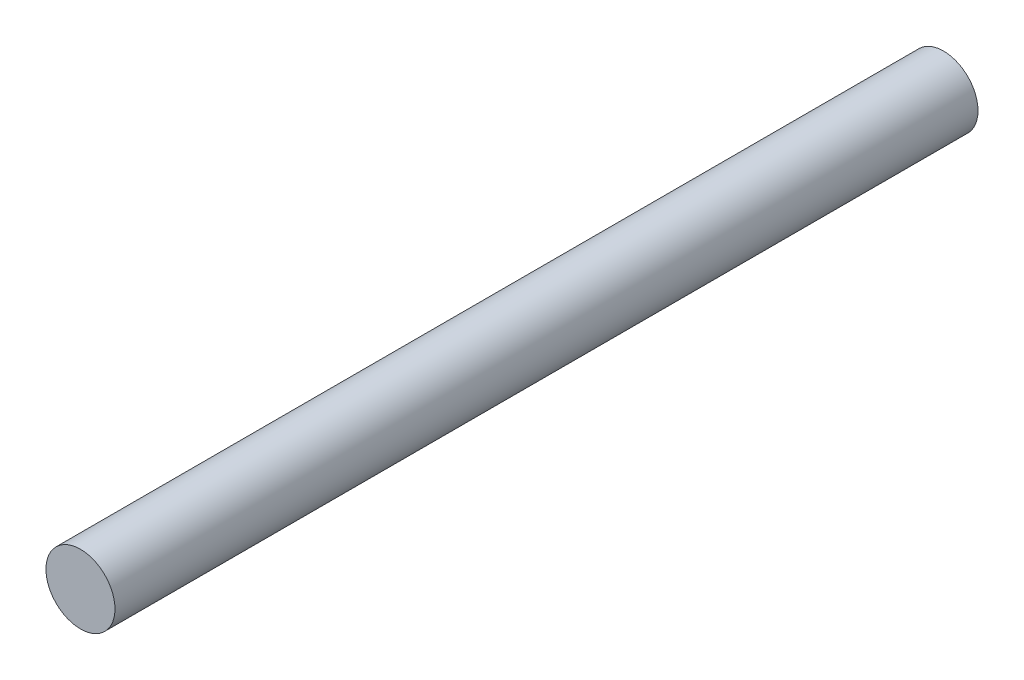
ISO-10303-21;
HEADER;
FILE_DESCRIPTION(('STEP AP214'),'2;1');
FILE_NAME('part.step','',(''),(''),'','','');
FILE_SCHEMA(('AUTOMOTIVE_DESIGN { 1 0 10303 214 1 1 1 1 }'));
ENDSEC;
DATA;
#1=APPLICATION_CONTEXT('core data for automotive mechanical design processes');
#2=APPLICATION_PROTOCOL_DEFINITION('international standard','automotive_design',2000,#1);
#3=PRODUCT_CONTEXT('',#1,'mechanical');
#4=PRODUCT('Part','Part','',(#3));
#5=PRODUCT_RELATED_PRODUCT_CATEGORY('part','',(#4));
#6=PRODUCT_DEFINITION_FORMATION('','',#4);
#7=PRODUCT_DEFINITION_CONTEXT('part definition',#1,'design');
#8=PRODUCT_DEFINITION('design','',#6,#7);
#9=PRODUCT_DEFINITION_SHAPE('','',#8);
#10=(LENGTH_UNIT() NAMED_UNIT(*) SI_UNIT(.MILLI.,.METRE.));
#11=(NAMED_UNIT(*) PLANE_ANGLE_UNIT() SI_UNIT($,.RADIAN.));
#12=(NAMED_UNIT(*) SI_UNIT($,.STERADIAN.) SOLID_ANGLE_UNIT());
#13=UNCERTAINTY_MEASURE_WITH_UNIT(LENGTH_MEASURE(1.E-05),#10,'distance_accuracy_value','');
#14=(GEOMETRIC_REPRESENTATION_CONTEXT(3) GLOBAL_UNCERTAINTY_ASSIGNED_CONTEXT((#13)) GLOBAL_UNIT_ASSIGNED_CONTEXT((#10,
#11,#12)) REPRESENTATION_CONTEXT('',''));
#15=CARTESIAN_POINT('',(0.,0.,0.));
#16=DIRECTION('',(0.,0.,1.));
#17=DIRECTION('',(1.,0.,0.));
#18=AXIS2_PLACEMENT_3D('',#15,#16,#17);
#19=CARTESIAN_POINT('',(0.,0.,100.));
#20=DIRECTION('',(0.,0.,-1.));
#21=DIRECTION('',(-1.,0.,0.));
#22=AXIS2_PLACEMENT_3D('',#19,#20,#21);
#23=CYLINDRICAL_SURFACE('',#22,4.);
#24=CARTESIAN_POINT('',(0.,0.,100.));
#25=DIRECTION('',(0.,0.,1.));
#26=DIRECTION('',(1.,0.,0.));
#27=AXIS2_PLACEMENT_3D('',#24,#25,#26);
#28=CIRCLE('',#27,4.);
#29=CARTESIAN_POINT('',(4.,0.,100.));
#30=VERTEX_POINT('',#29);
#31=EDGE_CURVE('E10',#30,#30,#28,.T.);
#32=ORIENTED_EDGE('',*,*,#31,.F.);
#33=EDGE_LOOP('',(#32));
#34=FACE_BOUND('',#33,.T.);
#35=CARTESIAN_POINT('',(0.,0.,0.));
#36=DIRECTION('',(0.,0.,1.));
#37=DIRECTION('',(1.,0.,0.));
#38=AXIS2_PLACEMENT_3D('',#35,#36,#37);
#39=CIRCLE('',#38,4.);
#40=CARTESIAN_POINT('',(4.,0.,0.));
#41=VERTEX_POINT('',#40);
#42=EDGE_CURVE('E40',#41,#41,#39,.T.);
#43=ORIENTED_EDGE('',*,*,#42,.T.);
#44=EDGE_LOOP('',(#43));
#45=FACE_BOUND('',#44,.T.);
#46=ADVANCED_FACE('F37',(#34,#45),#23,.T.);
#47=CARTESIAN_POINT('',(0.,0.,100.));
#48=DIRECTION('',(0.,0.,1.));
#49=DIRECTION('',(1.,0.,0.));
#50=AXIS2_PLACEMENT_3D('',#47,#48,#49);
#51=PLANE('',#50);
#52=ORIENTED_EDGE('',*,*,#31,.T.);
#53=EDGE_LOOP('',(#52));
#54=FACE_BOUND('',#53,.T.);
#55=ADVANCED_FACE('F54',(#54),#51,.T.);
#56=CARTESIAN_POINT('',(0.,0.,0.));
#57=DIRECTION('',(0.,0.,1.));
#58=DIRECTION('',(1.,0.,0.));
#59=AXIS2_PLACEMENT_3D('',#56,#57,#58);
#60=PLANE('',#59);
#61=ORIENTED_EDGE('',*,*,#42,.F.);
#62=EDGE_LOOP('',(#61));
#63=FACE_BOUND('',#62,.T.);
#64=ADVANCED_FACE('F52',(#63),#60,.F.);
#65=CLOSED_SHELL('',(#46,#55,#64));
#66=MANIFOLD_SOLID_BREP('B2',#65);
#67=ADVANCED_BREP_SHAPE_REPRESENTATION('',(#18,#66),#14);
#68=SHAPE_DEFINITION_REPRESENTATION(#9,#67);
ENDSEC;
END-ISO-10303-21;
